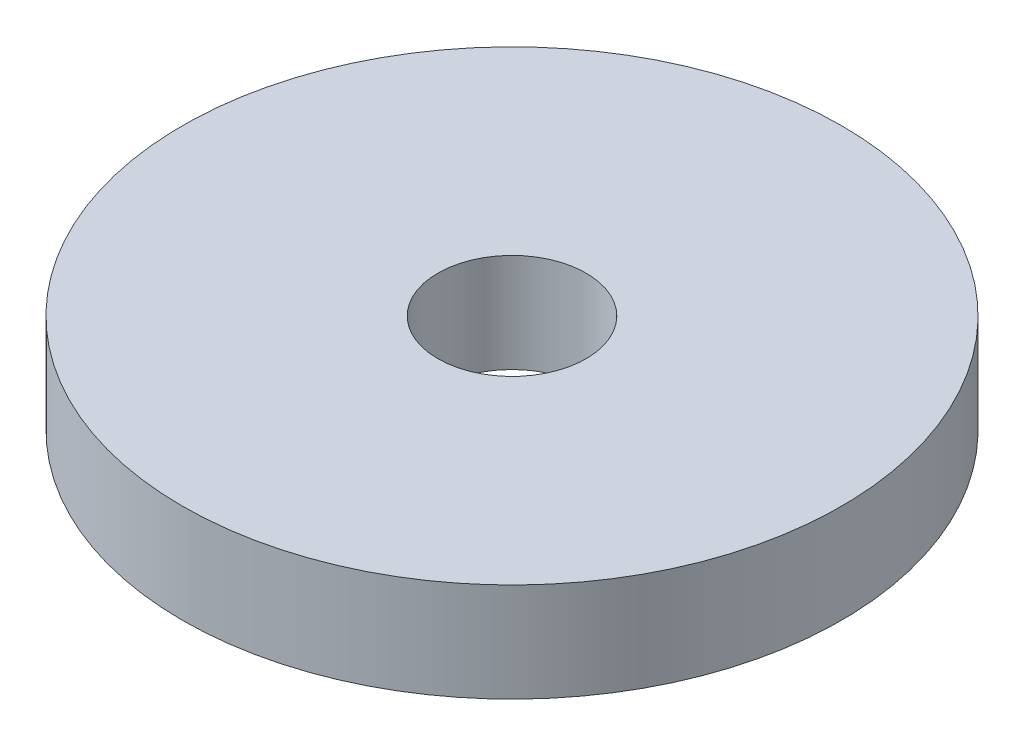
ISO-10303-21;
HEADER;
FILE_DESCRIPTION(('STEP AP214'),'2;1');
FILE_NAME('part.step','',(''),(''),'','','');
FILE_SCHEMA(('AUTOMOTIVE_DESIGN { 1 0 10303 214 1 1 1 1 }'));
ENDSEC;
DATA;
#1=APPLICATION_CONTEXT('core data for automotive mechanical design processes');
#2=APPLICATION_PROTOCOL_DEFINITION('international standard','automotive_design',2000,#1);
#3=PRODUCT_CONTEXT('',#1,'mechanical');
#4=PRODUCT('Part','Part','',(#3));
#5=PRODUCT_RELATED_PRODUCT_CATEGORY('part','',(#4));
#6=PRODUCT_DEFINITION_FORMATION('','',#4);
#7=PRODUCT_DEFINITION_CONTEXT('part definition',#1,'design');
#8=PRODUCT_DEFINITION('design','',#6,#7);
#9=PRODUCT_DEFINITION_SHAPE('','',#8);
#10=(LENGTH_UNIT() NAMED_UNIT(*) SI_UNIT(.MILLI.,.METRE.));
#11=(NAMED_UNIT(*) PLANE_ANGLE_UNIT() SI_UNIT($,.RADIAN.));
#12=(NAMED_UNIT(*) SI_UNIT($,.STERADIAN.) SOLID_ANGLE_UNIT());
#13=UNCERTAINTY_MEASURE_WITH_UNIT(LENGTH_MEASURE(1.E-05),#10,'distance_accuracy_value','');
#14=(GEOMETRIC_REPRESENTATION_CONTEXT(3) GLOBAL_UNCERTAINTY_ASSIGNED_CONTEXT((#13)) GLOBAL_UNIT_ASSIGNED_CONTEXT((#10,
#11,#12)) REPRESENTATION_CONTEXT('',''));
#15=CARTESIAN_POINT('',(0.,0.,0.));
#16=DIRECTION('',(0.,0.,1.));
#17=DIRECTION('',(1.,0.,0.));
#18=AXIS2_PLACEMENT_3D('',#15,#16,#17);
#19=CARTESIAN_POINT('',(0.,3.,0.));
#20=DIRECTION('',(0.,1.,0.));
#21=DIRECTION('',(0.,0.,1.));
#22=AXIS2_PLACEMENT_3D('',#19,#20,#21);
#23=PLANE('',#22);
#24=CARTESIAN_POINT('',(0.,3.,0.));
#25=DIRECTION('',(0.,1.,0.));
#26=DIRECTION('',(0.,0.,1.));
#27=AXIS2_PLACEMENT_3D('',#24,#25,#26);
#28=CIRCLE('',#27,10.);
#29=CARTESIAN_POINT('',(0.,3.,10.));
#30=VERTEX_POINT('',#29);
#31=EDGE_CURVE('E12',#30,#30,#28,.T.);
#32=ORIENTED_EDGE('',*,*,#31,.T.);
#33=EDGE_LOOP('',(#32));
#34=FACE_BOUND('',#33,.T.);
#35=CARTESIAN_POINT('',(0.,3.,0.));
#36=DIRECTION('',(0.,1.,0.));
#37=DIRECTION('',(0.,0.,1.));
#38=AXIS2_PLACEMENT_3D('',#35,#36,#37);
#39=CIRCLE('',#38,2.25);
#40=CARTESIAN_POINT('',(0.,3.,2.25));
#41=VERTEX_POINT('',#40);
#42=EDGE_CURVE('E55',#41,#41,#39,.T.);
#43=ORIENTED_EDGE('',*,*,#42,.F.);
#44=EDGE_LOOP('',(#43));
#45=FACE_BOUND('',#44,.T.);
#46=ADVANCED_FACE('F44',(#34,#45),#23,.T.);
#47=CARTESIAN_POINT('',(0.,0.,0.));
#48=DIRECTION('',(0.,1.,0.));
#49=DIRECTION('',(0.,0.,1.));
#50=AXIS2_PLACEMENT_3D('',#47,#48,#49);
#51=PLANE('',#50);
#52=CARTESIAN_POINT('',(0.,0.,0.));
#53=DIRECTION('',(0.,1.,0.));
#54=DIRECTION('',(0.,0.,1.));
#55=AXIS2_PLACEMENT_3D('',#52,#53,#54);
#56=CIRCLE('',#55,10.);
#57=CARTESIAN_POINT('',(0.,0.,10.));
#58=VERTEX_POINT('',#57);
#59=EDGE_CURVE('E48',#58,#58,#56,.T.);
#60=ORIENTED_EDGE('',*,*,#59,.F.);
#61=EDGE_LOOP('',(#60));
#62=FACE_BOUND('',#61,.T.);
#63=CARTESIAN_POINT('',(0.,0.,0.));
#64=DIRECTION('',(0.,1.,0.));
#65=DIRECTION('',(0.,0.,1.));
#66=AXIS2_PLACEMENT_3D('',#63,#64,#65);
#67=CIRCLE('',#66,2.25);
#68=CARTESIAN_POINT('',(0.,0.,2.25));
#69=VERTEX_POINT('',#68);
#70=EDGE_CURVE('E57',#69,#69,#67,.T.);
#71=ORIENTED_EDGE('',*,*,#70,.T.);
#72=EDGE_LOOP('',(#71));
#73=FACE_BOUND('',#72,.T.);
#74=ADVANCED_FACE('F67',(#62,#73),#51,.F.);
#75=CARTESIAN_POINT('',(0.,3.,0.));
#76=DIRECTION('',(0.,-1.,0.));
#77=DIRECTION('',(0.,0.,-1.));
#78=AXIS2_PLACEMENT_3D('',#75,#76,#77);
#79=CYLINDRICAL_SURFACE('',#78,10.);
#80=ORIENTED_EDGE('',*,*,#31,.F.);
#81=EDGE_LOOP('',(#80));
#82=FACE_BOUND('',#81,.T.);
#83=ORIENTED_EDGE('',*,*,#59,.T.);
#84=EDGE_LOOP('',(#83));
#85=FACE_BOUND('',#84,.T.);
#86=ADVANCED_FACE('F46',(#82,#85),#79,.T.);
#87=CARTESIAN_POINT('',(0.,3.,0.));
#88=DIRECTION('',(0.,-1.,0.));
#89=DIRECTION('',(0.,0.,-1.));
#90=AXIS2_PLACEMENT_3D('',#87,#88,#89);
#91=CYLINDRICAL_SURFACE('',#90,2.25);
#92=ORIENTED_EDGE('',*,*,#42,.T.);
#93=EDGE_LOOP('',(#92));
#94=FACE_BOUND('',#93,.T.);
#95=ORIENTED_EDGE('',*,*,#70,.F.);
#96=EDGE_LOOP('',(#95));
#97=FACE_BOUND('',#96,.T.);
#98=ADVANCED_FACE('F63',(#94,#97),#91,.F.);
#99=CLOSED_SHELL('',(#46,#74,#86,#98));
#100=MANIFOLD_SOLID_BREP('B2',#99);
#101=ADVANCED_BREP_SHAPE_REPRESENTATION('',(#18,#100),#14);
#102=SHAPE_DEFINITION_REPRESENTATION(#9,#101);
ENDSEC;
END-ISO-10303-21;
